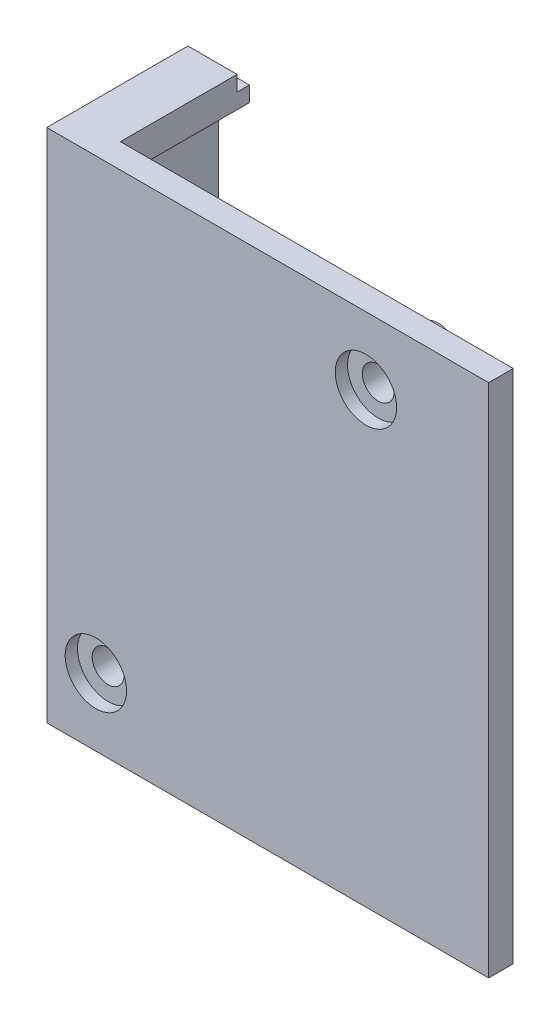
ISO-10303-21;
HEADER;
FILE_DESCRIPTION(('STEP AP214'),'2;1');
FILE_NAME('part.step','',(''),(''),'','','');
FILE_SCHEMA(('AUTOMOTIVE_DESIGN { 1 0 10303 214 1 1 1 1 }'));
ENDSEC;
DATA;
#1=APPLICATION_CONTEXT('core data for automotive mechanical design processes');
#2=APPLICATION_PROTOCOL_DEFINITION('international standard','automotive_design',2000,#1);
#3=PRODUCT_CONTEXT('',#1,'mechanical');
#4=PRODUCT('Part','Part','',(#3));
#5=PRODUCT_RELATED_PRODUCT_CATEGORY('part','',(#4));
#6=PRODUCT_DEFINITION_FORMATION('','',#4);
#7=PRODUCT_DEFINITION_CONTEXT('part definition',#1,'design');
#8=PRODUCT_DEFINITION('design','',#6,#7);
#9=PRODUCT_DEFINITION_SHAPE('','',#8);
#10=(LENGTH_UNIT() NAMED_UNIT(*) SI_UNIT(.MILLI.,.METRE.));
#11=(NAMED_UNIT(*) PLANE_ANGLE_UNIT() SI_UNIT($,.RADIAN.));
#12=(NAMED_UNIT(*) SI_UNIT($,.STERADIAN.) SOLID_ANGLE_UNIT());
#13=UNCERTAINTY_MEASURE_WITH_UNIT(LENGTH_MEASURE(1.E-05),#10,'distance_accuracy_value','');
#14=(GEOMETRIC_REPRESENTATION_CONTEXT(3) GLOBAL_UNCERTAINTY_ASSIGNED_CONTEXT((#13)) GLOBAL_UNIT_ASSIGNED_CONTEXT((#10,
#11,#12)) REPRESENTATION_CONTEXT('',''));
#15=CARTESIAN_POINT('',(0.,0.,0.));
#16=DIRECTION('',(0.,0.,1.));
#17=DIRECTION('',(1.,0.,0.));
#18=AXIS2_PLACEMENT_3D('',#15,#16,#17);
#19=CARTESIAN_POINT('',(-11.,-15.5,-3.9));
#20=DIRECTION('',(0.,0.,1.));
#21=DIRECTION('',(1.,0.,0.));
#22=AXIS2_PLACEMENT_3D('',#19,#20,#21);
#23=CYLINDRICAL_SURFACE('',#22,1.3);
#24=CARTESIAN_POINT('',(-11.,-15.5,-3.9));
#25=DIRECTION('',(0.,0.,-1.));
#26=DIRECTION('',(-1.,0.,0.));
#27=AXIS2_PLACEMENT_3D('',#24,#25,#26);
#28=CIRCLE('',#27,1.3);
#29=CARTESIAN_POINT('',(-12.3,-15.5,-3.9));
#30=VERTEX_POINT('',#29);
#31=EDGE_CURVE('E333',#30,#30,#28,.T.);
#32=ORIENTED_EDGE('',*,*,#31,.T.);
#33=EDGE_LOOP('',(#32));
#34=FACE_BOUND('',#33,.T.);
#35=CARTESIAN_POINT('',(-11.,-15.5,1.));
#36=DIRECTION('',(0.,0.,1.));
#37=DIRECTION('',(1.,0.,0.));
#38=AXIS2_PLACEMENT_3D('',#35,#36,#37);
#39=CIRCLE('',#38,1.3);
#40=CARTESIAN_POINT('',(-9.70000000000001,-15.5,1.));
#41=VERTEX_POINT('',#40);
#42=EDGE_CURVE('E41',#41,#41,#39,.T.);
#43=ORIENTED_EDGE('',*,*,#42,.T.);
#44=EDGE_LOOP('',(#43));
#45=FACE_BOUND('',#44,.T.);
#46=ADVANCED_FACE('F37',(#34,#45),#23,.F.);
#47=CARTESIAN_POINT('',(11.,15.5,-3.9));
#48=DIRECTION('',(0.,0.,1.));
#49=DIRECTION('',(1.,0.,0.));
#50=AXIS2_PLACEMENT_3D('',#47,#48,#49);
#51=CYLINDRICAL_SURFACE('',#50,1.3);
#52=CARTESIAN_POINT('',(11.,15.5,-3.9));
#53=DIRECTION('',(0.,0.,-1.));
#54=DIRECTION('',(-1.,0.,0.));
#55=AXIS2_PLACEMENT_3D('',#52,#53,#54);
#56=CIRCLE('',#55,1.3);
#57=CARTESIAN_POINT('',(9.69999999999999,15.5,-3.9));
#58=VERTEX_POINT('',#57);
#59=EDGE_CURVE('E308',#58,#58,#56,.T.);
#60=ORIENTED_EDGE('',*,*,#59,.T.);
#61=EDGE_LOOP('',(#60));
#62=FACE_BOUND('',#61,.T.);
#63=CARTESIAN_POINT('',(11.,15.5,1.));
#64=DIRECTION('',(0.,0.,1.));
#65=DIRECTION('',(1.,0.,0.));
#66=AXIS2_PLACEMENT_3D('',#63,#64,#65);
#67=CIRCLE('',#66,1.3);
#68=CARTESIAN_POINT('',(12.3,15.5,1.));
#69=VERTEX_POINT('',#68);
#70=EDGE_CURVE('E302',#69,#69,#67,.T.);
#71=ORIENTED_EDGE('',*,*,#70,.T.);
#72=EDGE_LOOP('',(#71));
#73=FACE_BOUND('',#72,.T.);
#74=ADVANCED_FACE('F418',(#62,#73),#51,.F.);
#75=CARTESIAN_POINT('',(21.,21.,2.));
#76=DIRECTION('',(-1.,0.,0.));
#77=DIRECTION('',(0.,0.,1.));
#78=AXIS2_PLACEMENT_3D('',#75,#76,#77);
#79=PLANE('',#78);
#80=DIRECTION('',(0.,1.,0.));
#81=VECTOR('',#80,1.);
#82=CARTESIAN_POINT('',(21.,21.,0.));
#83=LINE('',#82,#81);
#84=CARTESIAN_POINT('',(21.,-21.,0.));
#85=VERTEX_POINT('',#84);
#86=CARTESIAN_POINT('',(21.,21.,0.));
#87=VERTEX_POINT('',#86);
#88=EDGE_CURVE('E272',#85,#87,#83,.T.);
#89=ORIENTED_EDGE('',*,*,#88,.T.);
#90=DIRECTION('',(0.,0.,-1.));
#91=VECTOR('',#90,1.);
#92=CARTESIAN_POINT('',(21.,21.,2.));
#93=LINE('',#92,#91);
#94=CARTESIAN_POINT('',(21.,21.,2.));
#95=VERTEX_POINT('',#94);
#96=EDGE_CURVE('E296',#95,#87,#93,.T.);
#97=ORIENTED_EDGE('',*,*,#96,.F.);
#98=DIRECTION('',(0.,1.,0.));
#99=VECTOR('',#98,1.);
#100=CARTESIAN_POINT('',(21.,21.,2.));
#101=LINE('',#100,#99);
#102=CARTESIAN_POINT('',(21.,-21.,2.));
#103=VERTEX_POINT('',#102);
#104=EDGE_CURVE('E273',#103,#95,#101,.T.);
#105=ORIENTED_EDGE('',*,*,#104,.F.);
#106=DIRECTION('',(0.,0.,-1.));
#107=VECTOR('',#106,1.);
#108=CARTESIAN_POINT('',(21.,-21.,2.));
#109=LINE('',#108,#107);
#110=EDGE_CURVE('E283',#103,#85,#109,.T.);
#111=ORIENTED_EDGE('',*,*,#110,.T.);
#112=EDGE_LOOP('',(#89,#97,#105,#111));
#113=FACE_BOUND('',#112,.T.);
#114=ADVANCED_FACE('F39',(#113),#79,.F.);
#115=CARTESIAN_POINT('',(21.,21.,2.));
#116=DIRECTION('',(0.,-1.,0.));
#117=DIRECTION('',(0.,0.,-1.));
#118=AXIS2_PLACEMENT_3D('',#115,#116,#117);
#119=PLANE('',#118);
#120=DIRECTION('',(-1.,0.,0.));
#121=VECTOR('',#120,1.);
#122=CARTESIAN_POINT('',(21.,21.,0.));
#123=LINE('',#122,#121);
#124=CARTESIAN_POINT('',(-11.,21.,0.));
#125=VERTEX_POINT('',#124);
#126=EDGE_CURVE('E286',#87,#125,#123,.T.);
#127=ORIENTED_EDGE('',*,*,#126,.T.);
#128=DIRECTION('',(0.,0.,1.));
#129=VECTOR('',#128,1.);
#130=CARTESIAN_POINT('',(-11.,21.,-9.5));
#131=LINE('',#130,#129);
#132=CARTESIAN_POINT('',(-11.,21.,-9.5));
#133=VERTEX_POINT('',#132);
#134=EDGE_CURVE('E245',#133,#125,#131,.T.);
#135=ORIENTED_EDGE('',*,*,#134,.F.);
#136=DIRECTION('',(1.,0.,0.));
#137=VECTOR('',#136,1.);
#138=CARTESIAN_POINT('',(0.,21.,-9.5));
#139=LINE('',#138,#137);
#140=CARTESIAN_POINT('',(-15.,21.,-9.5));
#141=VERTEX_POINT('',#140);
#142=EDGE_CURVE('E243',#141,#133,#139,.T.);
#143=ORIENTED_EDGE('',*,*,#142,.F.);
#144=DIRECTION('',(0.,0.,-1.));
#145=VECTOR('',#144,1.);
#146=CARTESIAN_POINT('',(-15.,21.,2.));
#147=LINE('',#146,#145);
#148=CARTESIAN_POINT('',(-15.,21.,2.));
#149=VERTEX_POINT('',#148);
#150=EDGE_CURVE('E294',#149,#141,#147,.T.);
#151=ORIENTED_EDGE('',*,*,#150,.F.);
#152=DIRECTION('',(-1.,0.,0.));
#153=VECTOR('',#152,1.);
#154=CARTESIAN_POINT('',(21.,21.,2.));
#155=LINE('',#154,#153);
#156=EDGE_CURVE('E276',#95,#149,#155,.T.);
#157=ORIENTED_EDGE('',*,*,#156,.F.);
#158=ORIENTED_EDGE('',*,*,#96,.T.);
#159=EDGE_LOOP('',(#127,#135,#143,#151,#157,#158));
#160=FACE_BOUND('',#159,.T.);
#161=ADVANCED_FACE('F359',(#160),#119,.F.);
#162=CARTESIAN_POINT('',(-15.,21.,2.));
#163=DIRECTION('',(1.,0.,0.));
#164=DIRECTION('',(0.,0.,-1.));
#165=AXIS2_PLACEMENT_3D('',#162,#163,#164);
#166=PLANE('',#165);
#167=DIRECTION('',(0.,1.,0.));
#168=VECTOR('',#167,1.);
#169=CARTESIAN_POINT('',(-15.,-3.4,-2.35));
#170=LINE('',#169,#168);
#171=CARTESIAN_POINT('',(-15.,-3.4,-2.35));
#172=VERTEX_POINT('',#171);
#173=CARTESIAN_POINT('',(-15.,3.4,-2.35));
#174=VERTEX_POINT('',#173);
#175=EDGE_CURVE('E183',#172,#174,#170,.T.);
#176=ORIENTED_EDGE('',*,*,#175,.F.);
#177=CARTESIAN_POINT('',(-15.,-3.4,-3.95));
#178=DIRECTION('',(1.,0.,0.));
#179=DIRECTION('',(0.,0.,-1.));
#180=AXIS2_PLACEMENT_3D('',#177,#178,#179);
#181=CIRCLE('',#180,1.6);
#182=CARTESIAN_POINT('',(-15.,-3.4,-5.55));
#183=VERTEX_POINT('',#182);
#184=EDGE_CURVE('E165',#183,#172,#181,.F.);
#185=ORIENTED_EDGE('',*,*,#184,.F.);
#186=DIRECTION('',(0.,-1.,0.));
#187=VECTOR('',#186,1.);
#188=CARTESIAN_POINT('',(-15.,-3.4,-5.55));
#189=LINE('',#188,#187);
#190=CARTESIAN_POINT('',(-15.,3.4,-5.55));
#191=VERTEX_POINT('',#190);
#192=EDGE_CURVE('E174',#191,#183,#189,.T.);
#193=ORIENTED_EDGE('',*,*,#192,.F.);
#194=CARTESIAN_POINT('',(-15.,3.4,-3.95));
#195=DIRECTION('',(1.,0.,0.));
#196=DIRECTION('',(0.,0.,-1.));
#197=AXIS2_PLACEMENT_3D('',#194,#195,#196);
#198=CIRCLE('',#197,1.6);
#199=EDGE_CURVE('E54',#174,#191,#198,.F.);
#200=ORIENTED_EDGE('',*,*,#199,.F.);
#201=EDGE_LOOP('',(#176,#185,#193,#200));
#202=FACE_BOUND('',#201,.T.);
#203=ORIENTED_EDGE('',*,*,#150,.T.);
#204=DIRECTION('',(0.,1.,0.));
#205=VECTOR('',#204,1.);
#206=CARTESIAN_POINT('',(-15.,0.,-9.5));
#207=LINE('',#206,#205);
#208=CARTESIAN_POINT('',(-15.,-21.,-9.5));
#209=VERTEX_POINT('',#208);
#210=EDGE_CURVE('E240',#209,#141,#207,.T.);
#211=ORIENTED_EDGE('',*,*,#210,.F.);
#212=DIRECTION('',(0.,0.,-1.));
#213=VECTOR('',#212,1.);
#214=CARTESIAN_POINT('',(-15.,-21.,2.));
#215=LINE('',#214,#213);
#216=CARTESIAN_POINT('',(-15.,-21.,2.));
#217=VERTEX_POINT('',#216);
#218=EDGE_CURVE('E292',#217,#209,#215,.T.);
#219=ORIENTED_EDGE('',*,*,#218,.F.);
#220=DIRECTION('',(0.,-1.,0.));
#221=VECTOR('',#220,1.);
#222=CARTESIAN_POINT('',(-15.,21.,2.));
#223=LINE('',#222,#221);
#224=EDGE_CURVE('E279',#149,#217,#223,.T.);
#225=ORIENTED_EDGE('',*,*,#224,.F.);
#226=EDGE_LOOP('',(#203,#211,#219,#225));
#227=FACE_BOUND('',#226,.T.);
#228=ADVANCED_FACE('F180',(#202,#227),#166,.F.);
#229=CARTESIAN_POINT('',(21.,-21.,2.));
#230=DIRECTION('',(0.,1.,0.));
#231=DIRECTION('',(0.,0.,1.));
#232=AXIS2_PLACEMENT_3D('',#229,#230,#231);
#233=PLANE('',#232);
#234=ORIENTED_EDGE('',*,*,#218,.T.);
#235=DIRECTION('',(-1.,0.,0.));
#236=VECTOR('',#235,1.);
#237=CARTESIAN_POINT('',(0.,-21.,-9.5));
#238=LINE('',#237,#236);
#239=CARTESIAN_POINT('',(-11.,-21.,-9.5));
#240=VERTEX_POINT('',#239);
#241=EDGE_CURVE('E237',#240,#209,#238,.T.);
#242=ORIENTED_EDGE('',*,*,#241,.F.);
#243=DIRECTION('',(0.,0.,1.));
#244=VECTOR('',#243,1.);
#245=CARTESIAN_POINT('',(-11.,-21.,-9.5));
#246=LINE('',#245,#244);
#247=CARTESIAN_POINT('',(-11.,-21.,0.));
#248=VERTEX_POINT('',#247);
#249=EDGE_CURVE('E257',#240,#248,#246,.T.);
#250=ORIENTED_EDGE('',*,*,#249,.T.);
#251=DIRECTION('',(1.,0.,0.));
#252=VECTOR('',#251,1.);
#253=CARTESIAN_POINT('',(21.,-21.,0.));
#254=LINE('',#253,#252);
#255=EDGE_CURVE('E277',#248,#85,#254,.T.);
#256=ORIENTED_EDGE('',*,*,#255,.T.);
#257=ORIENTED_EDGE('',*,*,#110,.F.);
#258=DIRECTION('',(1.,0.,0.));
#259=VECTOR('',#258,1.);
#260=CARTESIAN_POINT('',(21.,-21.,2.));
#261=LINE('',#260,#259);
#262=EDGE_CURVE('E281',#217,#103,#261,.T.);
#263=ORIENTED_EDGE('',*,*,#262,.F.);
#264=EDGE_LOOP('',(#234,#242,#250,#256,#257,#263));
#265=FACE_BOUND('',#264,.T.);
#266=ADVANCED_FACE('F381',(#265),#233,.F.);
#267=CARTESIAN_POINT('',(0.,0.,2.));
#268=DIRECTION('',(0.,0.,-1.));
#269=DIRECTION('',(-1.,0.,0.));
#270=AXIS2_PLACEMENT_3D('',#267,#268,#269);
#271=PLANE('',#270);
#272=CARTESIAN_POINT('',(11.,15.5,2.));
#273=DIRECTION('',(0.,0.,1.));
#274=DIRECTION('',(1.,0.,0.));
#275=AXIS2_PLACEMENT_3D('',#272,#273,#274);
#276=CIRCLE('',#275,2.5);
#277=CARTESIAN_POINT('',(13.5,15.5,2.));
#278=VERTEX_POINT('',#277);
#279=EDGE_CURVE('E310',#278,#278,#276,.T.);
#280=ORIENTED_EDGE('',*,*,#279,.F.);
#281=EDGE_LOOP('',(#280));
#282=FACE_BOUND('',#281,.T.);
#283=CARTESIAN_POINT('',(-11.,-15.5,2.));
#284=DIRECTION('',(0.,0.,1.));
#285=DIRECTION('',(1.,0.,0.));
#286=AXIS2_PLACEMENT_3D('',#283,#284,#285);
#287=CIRCLE('',#286,2.5);
#288=CARTESIAN_POINT('',(-8.50000000000001,-15.5,2.));
#289=VERTEX_POINT('',#288);
#290=EDGE_CURVE('E323',#289,#289,#287,.T.);
#291=ORIENTED_EDGE('',*,*,#290,.F.);
#292=EDGE_LOOP('',(#291));
#293=FACE_BOUND('',#292,.T.);
#294=ORIENTED_EDGE('',*,*,#104,.T.);
#295=ORIENTED_EDGE('',*,*,#156,.T.);
#296=ORIENTED_EDGE('',*,*,#224,.T.);
#297=ORIENTED_EDGE('',*,*,#262,.T.);
#298=EDGE_LOOP('',(#294,#295,#296,#297));
#299=FACE_BOUND('',#298,.T.);
#300=ADVANCED_FACE('F351',(#282,#293,#299),#271,.F.);
#301=CARTESIAN_POINT('',(0.,0.,0.));
#302=DIRECTION('',(0.,0.,-1.));
#303=DIRECTION('',(-1.,0.,0.));
#304=AXIS2_PLACEMENT_3D('',#301,#302,#303);
#305=PLANE('',#304);
#306=CARTESIAN_POINT('',(8.14999999999999,0.,0.));
#307=DIRECTION('',(0.,0.,-1.));
#308=DIRECTION('',(-1.,0.,0.));
#309=AXIS2_PLACEMENT_3D('',#306,#307,#308);
#310=CIRCLE('',#309,2.);
#311=CARTESIAN_POINT('',(6.14999999999999,0.,0.));
#312=VERTEX_POINT('',#311);
#313=EDGE_CURVE('E318',#312,#312,#310,.T.);
#314=ORIENTED_EDGE('',*,*,#313,.F.);
#315=EDGE_LOOP('',(#314));
#316=FACE_BOUND('',#315,.T.);
#317=CARTESIAN_POINT('',(11.,15.5,0.));
#318=DIRECTION('',(0.,0.,-1.));
#319=DIRECTION('',(-1.,0.,0.));
#320=AXIS2_PLACEMENT_3D('',#317,#318,#319);
#321=CIRCLE('',#320,1.75);
#322=CARTESIAN_POINT('',(9.24999999999999,15.5,0.));
#323=VERTEX_POINT('',#322);
#324=EDGE_CURVE('E329',#323,#323,#321,.T.);
#325=ORIENTED_EDGE('',*,*,#324,.F.);
#326=EDGE_LOOP('',(#325));
#327=FACE_BOUND('',#326,.T.);
#328=CARTESIAN_POINT('',(-11.,-15.5,0.));
#329=DIRECTION('',(0.,0.,-1.));
#330=DIRECTION('',(-1.,0.,0.));
#331=AXIS2_PLACEMENT_3D('',#328,#329,#330);
#332=CIRCLE('',#331,1.75);
#333=CARTESIAN_POINT('',(-12.75,-15.5,0.));
#334=VERTEX_POINT('',#333);
#335=EDGE_CURVE('E338',#334,#334,#332,.T.);
#336=ORIENTED_EDGE('',*,*,#335,.F.);
#337=EDGE_LOOP('',(#336));
#338=FACE_BOUND('',#337,.T.);
#339=DIRECTION('',(0.,-1.,0.));
#340=VECTOR('',#339,1.);
#341=CARTESIAN_POINT('',(-11.,0.,0.));
#342=LINE('',#341,#340);
#343=CARTESIAN_POINT('',(-11.,18.5,0.));
#344=VERTEX_POINT('',#343);
#345=EDGE_CURVE('E231',#125,#344,#342,.T.);
#346=ORIENTED_EDGE('',*,*,#345,.F.);
#347=ORIENTED_EDGE('',*,*,#126,.F.);
#348=ORIENTED_EDGE('',*,*,#88,.F.);
#349=ORIENTED_EDGE('',*,*,#255,.F.);
#350=CARTESIAN_POINT('',(-11.,-18.5,0.));
#351=VERTEX_POINT('',#350);
#352=EDGE_CURVE('E236',#351,#248,#342,.T.);
#353=ORIENTED_EDGE('',*,*,#352,.F.);
#354=DIRECTION('',(-1.,0.,0.));
#355=VECTOR('',#354,1.);
#356=CARTESIAN_POINT('',(0.,-18.5,0.));
#357=LINE('',#356,#355);
#358=CARTESIAN_POINT('',(-13.5,-18.5,0.));
#359=VERTEX_POINT('',#358);
#360=EDGE_CURVE('E253',#351,#359,#357,.T.);
#361=ORIENTED_EDGE('',*,*,#360,.T.);
#362=DIRECTION('',(0.,-1.,0.));
#363=VECTOR('',#362,1.);
#364=CARTESIAN_POINT('',(-13.5,0.,0.));
#365=LINE('',#364,#363);
#366=CARTESIAN_POINT('',(-13.5,18.5,0.));
#367=VERTEX_POINT('',#366);
#368=EDGE_CURVE('E250',#367,#359,#365,.T.);
#369=ORIENTED_EDGE('',*,*,#368,.F.);
#370=DIRECTION('',(-1.,0.,0.));
#371=VECTOR('',#370,1.);
#372=CARTESIAN_POINT('',(0.,18.5,0.));
#373=LINE('',#372,#371);
#374=EDGE_CURVE('E247',#344,#367,#373,.T.);
#375=ORIENTED_EDGE('',*,*,#374,.F.);
#376=EDGE_LOOP('',(#346,#347,#348,#349,#353,#361,#369,#375));
#377=FACE_BOUND('',#376,.T.);
#378=ADVANCED_FACE('F347',(#316,#327,#338,#377),#305,.T.);
#379=CARTESIAN_POINT('',(-11.,0.,-9.5));
#380=DIRECTION('',(-1.,0.,0.));
#381=DIRECTION('',(0.,0.,1.));
#382=AXIS2_PLACEMENT_3D('',#379,#380,#381);
#383=PLANE('',#382);
#384=ORIENTED_EDGE('',*,*,#345,.T.);
#385=DIRECTION('',(0.,0.,1.));
#386=VECTOR('',#385,1.);
#387=CARTESIAN_POINT('',(-11.,18.5,-9.5));
#388=LINE('',#387,#386);
#389=CARTESIAN_POINT('',(-11.,18.5,-10.5));
#390=VERTEX_POINT('',#389);
#391=EDGE_CURVE('E269',#390,#344,#388,.T.);
#392=ORIENTED_EDGE('',*,*,#391,.F.);
#393=DIRECTION('',(0.,-1.,0.));
#394=VECTOR('',#393,1.);
#395=CARTESIAN_POINT('',(-11.,0.,-10.5));
#396=LINE('',#395,#394);
#397=CARTESIAN_POINT('',(-11.,19.75,-10.5));
#398=VERTEX_POINT('',#397);
#399=EDGE_CURVE('E205',#398,#390,#396,.T.);
#400=ORIENTED_EDGE('',*,*,#399,.F.);
#401=DIRECTION('',(0.,0.,1.));
#402=VECTOR('',#401,1.);
#403=CARTESIAN_POINT('',(-11.,19.75,-10.5));
#404=LINE('',#403,#402);
#405=CARTESIAN_POINT('',(-11.,19.75,-9.5));
#406=VERTEX_POINT('',#405);
#407=EDGE_CURVE('E225',#398,#406,#404,.T.);
#408=ORIENTED_EDGE('',*,*,#407,.T.);
#409=DIRECTION('',(0.,-1.,0.));
#410=VECTOR('',#409,1.);
#411=CARTESIAN_POINT('',(-11.,0.,-9.5));
#412=LINE('',#411,#410);
#413=EDGE_CURVE('E232',#133,#406,#412,.T.);
#414=ORIENTED_EDGE('',*,*,#413,.F.);
#415=ORIENTED_EDGE('',*,*,#134,.T.);
#416=EDGE_LOOP('',(#384,#392,#400,#408,#414,#415));
#417=FACE_BOUND('',#416,.T.);
#418=ADVANCED_FACE('F350',(#417),#383,.F.);
#419=CARTESIAN_POINT('',(0.,18.5,-9.5));
#420=DIRECTION('',(0.,1.,0.));
#421=DIRECTION('',(0.,0.,1.));
#422=AXIS2_PLACEMENT_3D('',#419,#420,#421);
#423=PLANE('',#422);
#424=ORIENTED_EDGE('',*,*,#374,.T.);
#425=DIRECTION('',(0.,0.,1.));
#426=VECTOR('',#425,1.);
#427=CARTESIAN_POINT('',(-13.5,18.5,-9.5));
#428=LINE('',#427,#426);
#429=CARTESIAN_POINT('',(-13.5,18.5,-10.5));
#430=VERTEX_POINT('',#429);
#431=EDGE_CURVE('E266',#430,#367,#428,.T.);
#432=ORIENTED_EDGE('',*,*,#431,.F.);
#433=DIRECTION('',(-1.,0.,0.));
#434=VECTOR('',#433,1.);
#435=CARTESIAN_POINT('',(0.,18.5,-10.5));
#436=LINE('',#435,#434);
#437=EDGE_CURVE('E208',#390,#430,#436,.T.);
#438=ORIENTED_EDGE('',*,*,#437,.F.);
#439=ORIENTED_EDGE('',*,*,#391,.T.);
#440=EDGE_LOOP('',(#424,#432,#438,#439));
#441=FACE_BOUND('',#440,.T.);
#442=ADVANCED_FACE('F393',(#441),#423,.F.);
#443=CARTESIAN_POINT('',(-13.5,0.,-9.5));
#444=DIRECTION('',(-1.,0.,0.));
#445=DIRECTION('',(0.,-1.,0.));
#446=AXIS2_PLACEMENT_3D('',#443,#444,#445);
#447=PLANE('',#446);
#448=DIRECTION('',(0.,1.,0.));
#449=VECTOR('',#448,1.);
#450=CARTESIAN_POINT('',(-13.5,-3.4,-5.55));
#451=LINE('',#450,#449);
#452=CARTESIAN_POINT('',(-13.5,-3.4,-5.55));
#453=VERTEX_POINT('',#452);
#454=CARTESIAN_POINT('',(-13.5,3.4,-5.55));
#455=VERTEX_POINT('',#454);
#456=EDGE_CURVE('E185',#453,#455,#451,.T.);
#457=ORIENTED_EDGE('',*,*,#456,.F.);
#458=CARTESIAN_POINT('',(-13.5,-3.4,-3.95));
#459=DIRECTION('',(1.,0.,0.));
#460=DIRECTION('',(0.,1.,0.));
#461=AXIS2_PLACEMENT_3D('',#458,#459,#460);
#462=CIRCLE('',#461,1.6);
#463=CARTESIAN_POINT('',(-13.5,-3.4,-2.35));
#464=VERTEX_POINT('',#463);
#465=EDGE_CURVE('E62',#464,#453,#462,.T.);
#466=ORIENTED_EDGE('',*,*,#465,.F.);
#467=DIRECTION('',(0.,-1.,0.));
#468=VECTOR('',#467,1.);
#469=CARTESIAN_POINT('',(-13.5,-3.4,-2.35));
#470=LINE('',#469,#468);
#471=CARTESIAN_POINT('',(-13.5,3.4,-2.35));
#472=VERTEX_POINT('',#471);
#473=EDGE_CURVE('E171',#472,#464,#470,.T.);
#474=ORIENTED_EDGE('',*,*,#473,.F.);
#475=CARTESIAN_POINT('',(-13.5,3.4,-3.95));
#476=DIRECTION('',(1.,0.,0.));
#477=DIRECTION('',(0.,1.,0.));
#478=AXIS2_PLACEMENT_3D('',#475,#476,#477);
#479=CIRCLE('',#478,1.6);
#480=EDGE_CURVE('E191',#455,#472,#479,.T.);
#481=ORIENTED_EDGE('',*,*,#480,.F.);
#482=EDGE_LOOP('',(#457,#466,#474,#481));
#483=FACE_BOUND('',#482,.T.);
#484=ORIENTED_EDGE('',*,*,#368,.T.);
#485=DIRECTION('',(0.,0.,1.));
#486=VECTOR('',#485,1.);
#487=CARTESIAN_POINT('',(-13.5,-18.5,-9.5));
#488=LINE('',#487,#486);
#489=CARTESIAN_POINT('',(-13.5,-18.5,-10.5));
#490=VERTEX_POINT('',#489);
#491=EDGE_CURVE('E263',#490,#359,#488,.T.);
#492=ORIENTED_EDGE('',*,*,#491,.F.);
#493=DIRECTION('',(0.,-1.,0.));
#494=VECTOR('',#493,1.);
#495=CARTESIAN_POINT('',(-13.5,0.,-10.5));
#496=LINE('',#495,#494);
#497=EDGE_CURVE('E212',#430,#490,#496,.T.);
#498=ORIENTED_EDGE('',*,*,#497,.F.);
#499=ORIENTED_EDGE('',*,*,#431,.T.);
#500=EDGE_LOOP('',(#484,#492,#498,#499));
#501=FACE_BOUND('',#500,.T.);
#502=ADVANCED_FACE('F396',(#483,#501),#447,.F.);
#503=CARTESIAN_POINT('',(0.,-18.5,-9.5));
#504=DIRECTION('',(0.,1.,0.));
#505=DIRECTION('',(0.,0.,1.));
#506=AXIS2_PLACEMENT_3D('',#503,#504,#505);
#507=PLANE('',#506);
#508=ORIENTED_EDGE('',*,*,#360,.F.);
#509=DIRECTION('',(0.,0.,1.));
#510=VECTOR('',#509,1.);
#511=CARTESIAN_POINT('',(-11.,-18.5,-9.5));
#512=LINE('',#511,#510);
#513=CARTESIAN_POINT('',(-11.,-18.5,-10.5));
#514=VERTEX_POINT('',#513);
#515=EDGE_CURVE('E260',#514,#351,#512,.T.);
#516=ORIENTED_EDGE('',*,*,#515,.F.);
#517=DIRECTION('',(-1.,0.,0.));
#518=VECTOR('',#517,1.);
#519=CARTESIAN_POINT('',(0.,-18.5,-10.5));
#520=LINE('',#519,#518);
#521=EDGE_CURVE('E215',#514,#490,#520,.T.);
#522=ORIENTED_EDGE('',*,*,#521,.T.);
#523=ORIENTED_EDGE('',*,*,#491,.T.);
#524=EDGE_LOOP('',(#508,#516,#522,#523));
#525=FACE_BOUND('',#524,.T.);
#526=ADVANCED_FACE('F390',(#525),#507,.T.);
#527=ORIENTED_EDGE('',*,*,#352,.T.);
#528=ORIENTED_EDGE('',*,*,#249,.F.);
#529=CARTESIAN_POINT('',(-11.,-19.75,-9.5));
#530=VERTEX_POINT('',#529);
#531=EDGE_CURVE('E235',#530,#240,#412,.T.);
#532=ORIENTED_EDGE('',*,*,#531,.F.);
#533=DIRECTION('',(0.,0.,1.));
#534=VECTOR('',#533,1.);
#535=CARTESIAN_POINT('',(-11.,-19.75,-10.5));
#536=LINE('',#535,#534);
#537=CARTESIAN_POINT('',(-11.,-19.75,-10.5));
#538=VERTEX_POINT('',#537);
#539=EDGE_CURVE('E223',#538,#530,#536,.T.);
#540=ORIENTED_EDGE('',*,*,#539,.F.);
#541=EDGE_CURVE('E209',#514,#538,#396,.T.);
#542=ORIENTED_EDGE('',*,*,#541,.F.);
#543=ORIENTED_EDGE('',*,*,#515,.T.);
#544=EDGE_LOOP('',(#527,#528,#532,#540,#542,#543));
#545=FACE_BOUND('',#544,.T.);
#546=ADVANCED_FACE('F384',(#545),#383,.F.);
#547=CARTESIAN_POINT('',(0.,0.,-9.5));
#548=DIRECTION('',(0.,0.,-1.));
#549=DIRECTION('',(-1.,0.,0.));
#550=AXIS2_PLACEMENT_3D('',#547,#548,#549);
#551=PLANE('',#550);
#552=DIRECTION('',(1.,0.,0.));
#553=VECTOR('',#552,1.);
#554=CARTESIAN_POINT('',(0.,19.75,-9.5));
#555=LINE('',#554,#553);
#556=CARTESIAN_POINT('',(-14.,19.75,-9.5));
#557=VERTEX_POINT('',#556);
#558=EDGE_CURVE('E11',#557,#406,#555,.T.);
#559=ORIENTED_EDGE('',*,*,#558,.F.);
#560=DIRECTION('',(0.,1.,0.));
#561=VECTOR('',#560,1.);
#562=CARTESIAN_POINT('',(-14.,0.,-9.5));
#563=LINE('',#562,#561);
#564=CARTESIAN_POINT('',(-14.,-19.75,-9.5));
#565=VERTEX_POINT('',#564);
#566=EDGE_CURVE('E46',#565,#557,#563,.T.);
#567=ORIENTED_EDGE('',*,*,#566,.F.);
#568=DIRECTION('',(1.,0.,0.));
#569=VECTOR('',#568,1.);
#570=CARTESIAN_POINT('',(0.,-19.75,-9.5));
#571=LINE('',#570,#569);
#572=EDGE_CURVE('E299',#565,#530,#571,.T.);
#573=ORIENTED_EDGE('',*,*,#572,.T.);
#574=ORIENTED_EDGE('',*,*,#531,.T.);
#575=ORIENTED_EDGE('',*,*,#241,.T.);
#576=ORIENTED_EDGE('',*,*,#210,.T.);
#577=ORIENTED_EDGE('',*,*,#142,.T.);
#578=ORIENTED_EDGE('',*,*,#413,.T.);
#579=EDGE_LOOP('',(#559,#567,#573,#574,#575,#576,#577,#578));
#580=FACE_BOUND('',#579,.T.);
#581=ADVANCED_FACE('F366',(#580),#551,.T.);
#582=CARTESIAN_POINT('',(-14.,0.,-10.5));
#583=DIRECTION('',(-1.,0.,0.));
#584=DIRECTION('',(0.,-1.,0.));
#585=AXIS2_PLACEMENT_3D('',#582,#583,#584);
#586=PLANE('',#585);
#587=DIRECTION('',(0.,0.,1.));
#588=VECTOR('',#587,1.);
#589=CARTESIAN_POINT('',(-14.,-19.75,-10.5));
#590=LINE('',#589,#588);
#591=CARTESIAN_POINT('',(-14.,-19.75,-10.5));
#592=VERTEX_POINT('',#591);
#593=EDGE_CURVE('E220',#592,#565,#590,.T.);
#594=ORIENTED_EDGE('',*,*,#593,.T.);
#595=ORIENTED_EDGE('',*,*,#566,.T.);
#596=DIRECTION('',(0.,0.,1.));
#597=VECTOR('',#596,1.);
#598=CARTESIAN_POINT('',(-14.,19.75,-10.5));
#599=LINE('',#598,#597);
#600=CARTESIAN_POINT('',(-14.,19.75,-10.5));
#601=VERTEX_POINT('',#600);
#602=EDGE_CURVE('E228',#601,#557,#599,.T.);
#603=ORIENTED_EDGE('',*,*,#602,.F.);
#604=DIRECTION('',(0.,-1.,0.));
#605=VECTOR('',#604,1.);
#606=CARTESIAN_POINT('',(-14.,0.,-10.5));
#607=LINE('',#606,#605);
#608=EDGE_CURVE('E177',#601,#592,#607,.T.);
#609=ORIENTED_EDGE('',*,*,#608,.T.);
#610=EDGE_LOOP('',(#594,#595,#603,#609));
#611=FACE_BOUND('',#610,.T.);
#612=ADVANCED_FACE('F404',(#611),#586,.T.);
#613=CARTESIAN_POINT('',(0.,19.75,-10.5));
#614=DIRECTION('',(0.,1.,0.));
#615=DIRECTION('',(0.,0.,1.));
#616=AXIS2_PLACEMENT_3D('',#613,#614,#615);
#617=PLANE('',#616);
#618=ORIENTED_EDGE('',*,*,#602,.T.);
#619=ORIENTED_EDGE('',*,*,#558,.T.);
#620=ORIENTED_EDGE('',*,*,#407,.F.);
#621=DIRECTION('',(-1.,0.,0.));
#622=VECTOR('',#621,1.);
#623=CARTESIAN_POINT('',(0.,19.75,-10.5));
#624=LINE('',#623,#622);
#625=EDGE_CURVE('E202',#398,#601,#624,.T.);
#626=ORIENTED_EDGE('',*,*,#625,.T.);
#627=EDGE_LOOP('',(#618,#619,#620,#626));
#628=FACE_BOUND('',#627,.T.);
#629=ADVANCED_FACE('F402',(#628),#617,.T.);
#630=CARTESIAN_POINT('',(0.,-19.75,-10.5));
#631=DIRECTION('',(0.,1.,0.));
#632=DIRECTION('',(0.,0.,1.));
#633=AXIS2_PLACEMENT_3D('',#630,#631,#632);
#634=PLANE('',#633);
#635=ORIENTED_EDGE('',*,*,#572,.F.);
#636=ORIENTED_EDGE('',*,*,#593,.F.);
#637=DIRECTION('',(-1.,0.,0.));
#638=VECTOR('',#637,1.);
#639=CARTESIAN_POINT('',(0.,-19.75,-10.5));
#640=LINE('',#639,#638);
#641=EDGE_CURVE('E218',#538,#592,#640,.T.);
#642=ORIENTED_EDGE('',*,*,#641,.F.);
#643=ORIENTED_EDGE('',*,*,#539,.T.);
#644=EDGE_LOOP('',(#635,#636,#642,#643));
#645=FACE_BOUND('',#644,.T.);
#646=ADVANCED_FACE('F407',(#645),#634,.F.);
#647=CARTESIAN_POINT('',(0.,0.,-10.5));
#648=DIRECTION('',(0.,0.,-1.));
#649=DIRECTION('',(-1.,0.,0.));
#650=AXIS2_PLACEMENT_3D('',#647,#648,#649);
#651=PLANE('',#650);
#652=ORIENTED_EDGE('',*,*,#608,.F.);
#653=ORIENTED_EDGE('',*,*,#625,.F.);
#654=ORIENTED_EDGE('',*,*,#399,.T.);
#655=ORIENTED_EDGE('',*,*,#437,.T.);
#656=ORIENTED_EDGE('',*,*,#497,.T.);
#657=ORIENTED_EDGE('',*,*,#521,.F.);
#658=ORIENTED_EDGE('',*,*,#541,.T.);
#659=ORIENTED_EDGE('',*,*,#641,.T.);
#660=EDGE_LOOP('',(#652,#653,#654,#655,#656,#657,#658,#659));
#661=FACE_BOUND('',#660,.T.);
#662=ADVANCED_FACE('F399',(#661),#651,.T.);
#663=CARTESIAN_POINT('',(-15.001,-3.4,-3.95));
#664=DIRECTION('',(1.,0.,0.));
#665=DIRECTION('',(0.,1.,0.));
#666=AXIS2_PLACEMENT_3D('',#663,#664,#665);
#667=CYLINDRICAL_SURFACE('',#666,1.6);
#668=ORIENTED_EDGE('',*,*,#184,.T.);
#669=DIRECTION('',(1.,0.,0.));
#670=VECTOR('',#669,1.);
#671=CARTESIAN_POINT('',(-15.001,-3.4,-2.35));
#672=LINE('',#671,#670);
#673=EDGE_CURVE('E178',#172,#464,#672,.T.);
#674=ORIENTED_EDGE('',*,*,#673,.T.);
#675=ORIENTED_EDGE('',*,*,#465,.T.);
#676=DIRECTION('',(1.,0.,0.));
#677=VECTOR('',#676,1.);
#678=CARTESIAN_POINT('',(-15.001,-3.4,-5.55));
#679=LINE('',#678,#677);
#680=EDGE_CURVE('E161',#183,#453,#679,.T.);
#681=ORIENTED_EDGE('',*,*,#680,.F.);
#682=EDGE_LOOP('',(#668,#674,#675,#681));
#683=FACE_BOUND('',#682,.T.);
#684=ADVANCED_FACE('F163',(#683),#667,.F.);
#685=CARTESIAN_POINT('',(-15.001,-3.4,-2.35));
#686=DIRECTION('',(0.,0.,1.));
#687=DIRECTION('',(1.,0.,0.));
#688=AXIS2_PLACEMENT_3D('',#685,#686,#687);
#689=PLANE('',#688);
#690=ORIENTED_EDGE('',*,*,#175,.T.);
#691=DIRECTION('',(1.,0.,0.));
#692=VECTOR('',#691,1.);
#693=CARTESIAN_POINT('',(-15.001,3.4,-2.35));
#694=LINE('',#693,#692);
#695=EDGE_CURVE('E197',#174,#472,#694,.T.);
#696=ORIENTED_EDGE('',*,*,#695,.T.);
#697=ORIENTED_EDGE('',*,*,#473,.T.);
#698=ORIENTED_EDGE('',*,*,#673,.F.);
#699=EDGE_LOOP('',(#690,#696,#697,#698));
#700=FACE_BOUND('',#699,.T.);
#701=ADVANCED_FACE('F439',(#700),#689,.F.);
#702=CARTESIAN_POINT('',(-15.001,3.4,-3.95));
#703=DIRECTION('',(1.,0.,0.));
#704=DIRECTION('',(0.,1.,0.));
#705=AXIS2_PLACEMENT_3D('',#702,#703,#704);
#706=CYLINDRICAL_SURFACE('',#705,1.6);
#707=ORIENTED_EDGE('',*,*,#199,.T.);
#708=DIRECTION('',(1.,0.,0.));
#709=VECTOR('',#708,1.);
#710=CARTESIAN_POINT('',(-15.001,3.4,-5.55));
#711=LINE('',#710,#709);
#712=EDGE_CURVE('E170',#191,#455,#711,.T.);
#713=ORIENTED_EDGE('',*,*,#712,.T.);
#714=ORIENTED_EDGE('',*,*,#480,.T.);
#715=ORIENTED_EDGE('',*,*,#695,.F.);
#716=EDGE_LOOP('',(#707,#713,#714,#715));
#717=FACE_BOUND('',#716,.T.);
#718=ADVANCED_FACE('F442',(#717),#706,.F.);
#719=CARTESIAN_POINT('',(-15.001,-3.4,-5.55));
#720=DIRECTION('',(0.,0.,-1.));
#721=DIRECTION('',(-1.,0.,0.));
#722=AXIS2_PLACEMENT_3D('',#719,#720,#721);
#723=PLANE('',#722);
#724=ORIENTED_EDGE('',*,*,#192,.T.);
#725=ORIENTED_EDGE('',*,*,#680,.T.);
#726=ORIENTED_EDGE('',*,*,#456,.T.);
#727=ORIENTED_EDGE('',*,*,#712,.F.);
#728=EDGE_LOOP('',(#724,#725,#726,#727));
#729=FACE_BOUND('',#728,.T.);
#730=ADVANCED_FACE('F175',(#729),#723,.F.);
#731=CARTESIAN_POINT('',(-11.,-15.5,-3.9));
#732=DIRECTION('',(0.,0.,-1.));
#733=DIRECTION('',(-1.,0.,0.));
#734=AXIS2_PLACEMENT_3D('',#731,#732,#733);
#735=PLANE('',#734);
#736=CARTESIAN_POINT('',(-11.,-15.5,-3.9));
#737=DIRECTION('',(0.,0.,-1.));
#738=DIRECTION('',(-1.,0.,0.));
#739=AXIS2_PLACEMENT_3D('',#736,#737,#738);
#740=CIRCLE('',#739,1.75);
#741=CARTESIAN_POINT('',(-12.75,-15.5,-3.9));
#742=VERTEX_POINT('',#741);
#743=EDGE_CURVE('E339',#742,#742,#740,.T.);
#744=ORIENTED_EDGE('',*,*,#743,.T.);
#745=EDGE_LOOP('',(#744));
#746=FACE_BOUND('',#745,.T.);
#747=ORIENTED_EDGE('',*,*,#31,.F.);
#748=EDGE_LOOP('',(#747));
#749=FACE_BOUND('',#748,.T.);
#750=ADVANCED_FACE('F431',(#746,#749),#735,.T.);
#751=CARTESIAN_POINT('',(-11.,-15.5,-3.9));
#752=DIRECTION('',(0.,0.,1.));
#753=DIRECTION('',(1.,0.,0.));
#754=AXIS2_PLACEMENT_3D('',#751,#752,#753);
#755=CYLINDRICAL_SURFACE('',#754,1.75);
#756=ORIENTED_EDGE('',*,*,#743,.F.);
#757=EDGE_LOOP('',(#756));
#758=FACE_BOUND('',#757,.T.);
#759=ORIENTED_EDGE('',*,*,#335,.T.);
#760=EDGE_LOOP('',(#759));
#761=FACE_BOUND('',#760,.T.);
#762=ADVANCED_FACE('F345',(#758,#761),#755,.T.);
#763=CARTESIAN_POINT('',(11.,15.5,-3.9));
#764=DIRECTION('',(0.,0.,-1.));
#765=DIRECTION('',(-1.,0.,0.));
#766=AXIS2_PLACEMENT_3D('',#763,#764,#765);
#767=PLANE('',#766);
#768=CARTESIAN_POINT('',(11.,15.5,-3.9));
#769=DIRECTION('',(0.,0.,-1.));
#770=DIRECTION('',(-1.,0.,0.));
#771=AXIS2_PLACEMENT_3D('',#768,#769,#770);
#772=CIRCLE('',#771,1.75);
#773=CARTESIAN_POINT('',(9.24999999999999,15.5,-3.9));
#774=VERTEX_POINT('',#773);
#775=EDGE_CURVE('E330',#774,#774,#772,.T.);
#776=ORIENTED_EDGE('',*,*,#775,.T.);
#777=EDGE_LOOP('',(#776));
#778=FACE_BOUND('',#777,.T.);
#779=ORIENTED_EDGE('',*,*,#59,.F.);
#780=EDGE_LOOP('',(#779));
#781=FACE_BOUND('',#780,.T.);
#782=ADVANCED_FACE('F437',(#778,#781),#767,.T.);
#783=CARTESIAN_POINT('',(11.,15.5,-3.9));
#784=DIRECTION('',(0.,0.,1.));
#785=DIRECTION('',(1.,0.,0.));
#786=AXIS2_PLACEMENT_3D('',#783,#784,#785);
#787=CYLINDRICAL_SURFACE('',#786,1.75);
#788=ORIENTED_EDGE('',*,*,#775,.F.);
#789=EDGE_LOOP('',(#788));
#790=FACE_BOUND('',#789,.T.);
#791=ORIENTED_EDGE('',*,*,#324,.T.);
#792=EDGE_LOOP('',(#791));
#793=FACE_BOUND('',#792,.T.);
#794=ADVANCED_FACE('F429',(#790,#793),#787,.T.);
#795=CARTESIAN_POINT('',(11.,15.5,1.));
#796=DIRECTION('',(0.,0.,1.));
#797=DIRECTION('',(1.,0.,0.));
#798=AXIS2_PLACEMENT_3D('',#795,#796,#797);
#799=CYLINDRICAL_SURFACE('',#798,2.5);
#800=CARTESIAN_POINT('',(11.,15.5,1.));
#801=DIRECTION('',(0.,0.,1.));
#802=DIRECTION('',(1.,0.,0.));
#803=AXIS2_PLACEMENT_3D('',#800,#801,#802);
#804=CIRCLE('',#803,2.5);
#805=CARTESIAN_POINT('',(13.5,15.5,1.));
#806=VERTEX_POINT('',#805);
#807=EDGE_CURVE('E304',#806,#806,#804,.T.);
#808=ORIENTED_EDGE('',*,*,#807,.F.);
#809=EDGE_LOOP('',(#808));
#810=FACE_BOUND('',#809,.T.);
#811=ORIENTED_EDGE('',*,*,#279,.T.);
#812=EDGE_LOOP('',(#811));
#813=FACE_BOUND('',#812,.T.);
#814=ADVANCED_FACE('F486',(#810,#813),#799,.F.);
#815=CARTESIAN_POINT('',(11.,15.5,1.));
#816=DIRECTION('',(0.,0.,1.));
#817=DIRECTION('',(1.,0.,0.));
#818=AXIS2_PLACEMENT_3D('',#815,#816,#817);
#819=PLANE('',#818);
#820=ORIENTED_EDGE('',*,*,#70,.F.);
#821=EDGE_LOOP('',(#820));
#822=FACE_BOUND('',#821,.T.);
#823=ORIENTED_EDGE('',*,*,#807,.T.);
#824=EDGE_LOOP('',(#823));
#825=FACE_BOUND('',#824,.T.);
#826=ADVANCED_FACE('F493',(#822,#825),#819,.T.);
#827=CARTESIAN_POINT('',(-11.,-15.5,1.));
#828=DIRECTION('',(0.,0.,1.));
#829=DIRECTION('',(1.,0.,0.));
#830=AXIS2_PLACEMENT_3D('',#827,#828,#829);
#831=CYLINDRICAL_SURFACE('',#830,2.5);
#832=CARTESIAN_POINT('',(-11.,-15.5,1.));
#833=DIRECTION('',(0.,0.,1.));
#834=DIRECTION('',(1.,0.,0.));
#835=AXIS2_PLACEMENT_3D('',#832,#833,#834);
#836=CIRCLE('',#835,2.5);
#837=CARTESIAN_POINT('',(-8.50000000000001,-15.5,1.));
#838=VERTEX_POINT('',#837);
#839=EDGE_CURVE('E315',#838,#838,#836,.T.);
#840=ORIENTED_EDGE('',*,*,#839,.F.);
#841=EDGE_LOOP('',(#840));
#842=FACE_BOUND('',#841,.T.);
#843=ORIENTED_EDGE('',*,*,#290,.T.);
#844=EDGE_LOOP('',(#843));
#845=FACE_BOUND('',#844,.T.);
#846=ADVANCED_FACE('F502',(#842,#845),#831,.F.);
#847=CARTESIAN_POINT('',(-11.,-15.5,1.));
#848=DIRECTION('',(0.,0.,1.));
#849=DIRECTION('',(1.,0.,0.));
#850=AXIS2_PLACEMENT_3D('',#847,#848,#849);
#851=PLANE('',#850);
#852=ORIENTED_EDGE('',*,*,#42,.F.);
#853=EDGE_LOOP('',(#852));
#854=FACE_BOUND('',#853,.T.);
#855=ORIENTED_EDGE('',*,*,#839,.T.);
#856=EDGE_LOOP('',(#855));
#857=FACE_BOUND('',#856,.T.);
#858=ADVANCED_FACE('F510',(#854,#857),#851,.T.);
#859=CARTESIAN_POINT('',(8.14999999999999,0.,1.5));
#860=DIRECTION('',(0.,0.,-1.));
#861=DIRECTION('',(-1.,0.,0.));
#862=AXIS2_PLACEMENT_3D('',#859,#860,#861);
#863=CYLINDRICAL_SURFACE('',#862,2.);
#864=CARTESIAN_POINT('',(8.14999999999999,0.,1.5));
#865=DIRECTION('',(0.,0.,-1.));
#866=DIRECTION('',(-1.,0.,0.));
#867=AXIS2_PLACEMENT_3D('',#864,#865,#866);
#868=CIRCLE('',#867,2.);
#869=CARTESIAN_POINT('',(6.14999999999999,0.,1.5));
#870=VERTEX_POINT('',#869);
#871=EDGE_CURVE('E326',#870,#870,#868,.T.);
#872=ORIENTED_EDGE('',*,*,#871,.F.);
#873=EDGE_LOOP('',(#872));
#874=FACE_BOUND('',#873,.T.);
#875=ORIENTED_EDGE('',*,*,#313,.T.);
#876=EDGE_LOOP('',(#875));
#877=FACE_BOUND('',#876,.T.);
#878=ADVANCED_FACE('F518',(#874,#877),#863,.F.);
#879=CARTESIAN_POINT('',(8.14999999999999,0.,1.5));
#880=DIRECTION('',(0.,0.,-1.));
#881=DIRECTION('',(-1.,0.,0.));
#882=AXIS2_PLACEMENT_3D('',#879,#880,#881);
#883=PLANE('',#882);
#884=ORIENTED_EDGE('',*,*,#871,.T.);
#885=EDGE_LOOP('',(#884));
#886=FACE_BOUND('',#885,.T.);
#887=ADVANCED_FACE('F527',(#886),#883,.T.);
#888=CLOSED_SHELL('',(#46,#74,#114,#161,#228,#266,#300,#378,#418,#442,#502,#526,#546,#581,#612,
#629,#646,#662,#684,#701,#718,#730,#750,#762,#782,#794,#814,#826,#846,#858,#878,#887));
#889=MANIFOLD_SOLID_BREP('B2',#888);
#890=ADVANCED_BREP_SHAPE_REPRESENTATION('',(#18,#889),#14);
#891=SHAPE_DEFINITION_REPRESENTATION(#9,#890);
ENDSEC;
END-ISO-10303-21;
